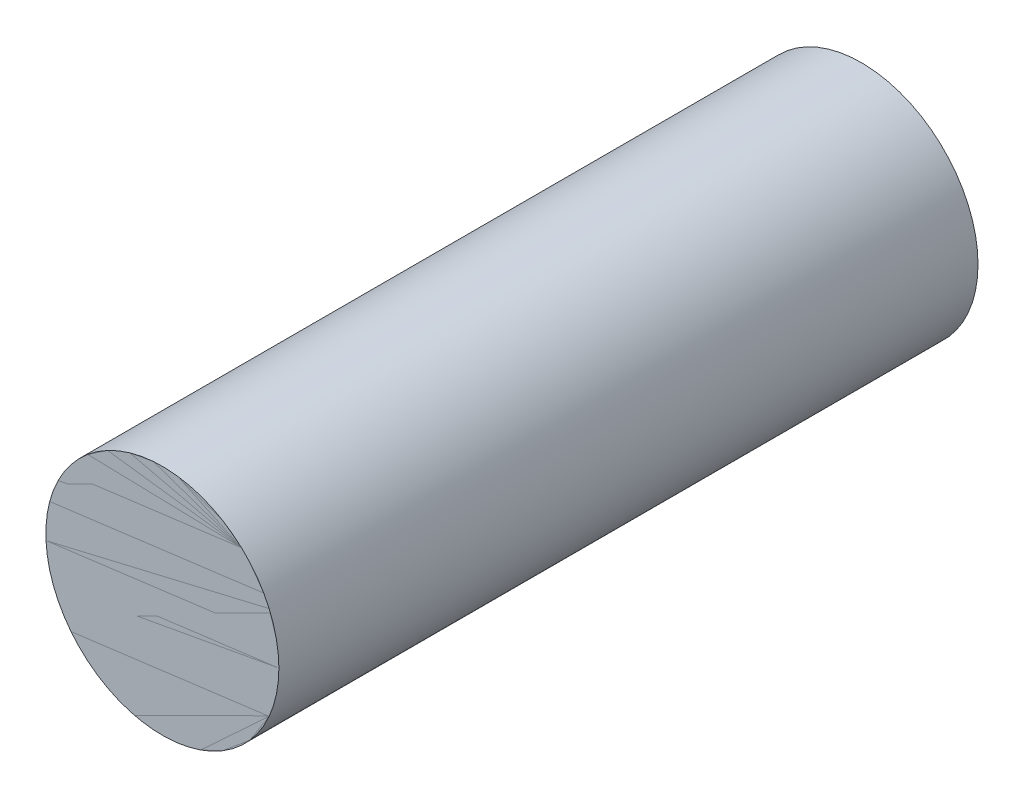
ISO-10303-21;
HEADER;
FILE_DESCRIPTION(('STEP AP214'),'2;1');
FILE_NAME('part.step','',(''),(''),'','','');
FILE_SCHEMA(('AUTOMOTIVE_DESIGN { 1 0 10303 214 1 1 1 1 }'));
ENDSEC;
DATA;
#1=APPLICATION_CONTEXT('core data for automotive mechanical design processes');
#2=APPLICATION_PROTOCOL_DEFINITION('international standard','automotive_design',2000,#1);
#3=PRODUCT_CONTEXT('',#1,'mechanical');
#4=PRODUCT('Part','Part','',(#3));
#5=PRODUCT_RELATED_PRODUCT_CATEGORY('part','',(#4));
#6=PRODUCT_DEFINITION_FORMATION('','',#4);
#7=PRODUCT_DEFINITION_CONTEXT('part definition',#1,'design');
#8=PRODUCT_DEFINITION('design','',#6,#7);
#9=PRODUCT_DEFINITION_SHAPE('','',#8);
#10=(LENGTH_UNIT() NAMED_UNIT(*) SI_UNIT(.MILLI.,.METRE.));
#11=(NAMED_UNIT(*) PLANE_ANGLE_UNIT() SI_UNIT($,.RADIAN.));
#12=(NAMED_UNIT(*) SI_UNIT($,.STERADIAN.) SOLID_ANGLE_UNIT());
#13=UNCERTAINTY_MEASURE_WITH_UNIT(LENGTH_MEASURE(1.E-05),#10,'distance_accuracy_value','');
#14=(GEOMETRIC_REPRESENTATION_CONTEXT(3) GLOBAL_UNCERTAINTY_ASSIGNED_CONTEXT((#13)) GLOBAL_UNIT_ASSIGNED_CONTEXT((#10,
#11,#12)) REPRESENTATION_CONTEXT('',''));
#15=CARTESIAN_POINT('',(0.,0.,0.));
#16=DIRECTION('',(0.,0.,1.));
#17=DIRECTION('',(1.,0.,0.));
#18=AXIS2_PLACEMENT_3D('',#15,#16,#17);
#19=CARTESIAN_POINT('',(-175.270710986926,-60.4180736437963,-9.79999999999999));
#20=DIRECTION('',(0.,0.,1.));
#21=DIRECTION('',(1.,0.,0.));
#22=AXIS2_PLACEMENT_3D('',#19,#20,#21);
#23=CYLINDRICAL_SURFACE('',#22,0.300000000000013);
#24=CARTESIAN_POINT('',(-175.270710986926,-60.4180736437963,-9.79999999999999));
#25=DIRECTION('',(0.,0.,1.));
#26=DIRECTION('',(1.,0.,0.));
#27=AXIS2_PLACEMENT_3D('',#24,#25,#26);
#28=CIRCLE('',#27,0.300000000000013);
#29=CARTESIAN_POINT('',(-174.970710986926,-60.4180736437963,-9.79999999999999));
#30=VERTEX_POINT('',#29);
#31=EDGE_CURVE('E11',#30,#30,#28,.T.);
#32=ORIENTED_EDGE('',*,*,#31,.T.);
#33=EDGE_LOOP('',(#32));
#34=FACE_BOUND('',#33,.T.);
#35=CARTESIAN_POINT('',(-175.270710986926,-60.4180736437963,-7.99999999999999));
#36=DIRECTION('',(0.,0.,1.));
#37=DIRECTION('',(1.,0.,0.));
#38=AXIS2_PLACEMENT_3D('',#35,#36,#37);
#39=CIRCLE('',#38,0.300000000000013);
#40=CARTESIAN_POINT('',(-174.970710986926,-60.4180736437963,-7.99999999999999));
#41=VERTEX_POINT('',#40);
#42=EDGE_CURVE('E46',#41,#41,#39,.T.);
#43=ORIENTED_EDGE('',*,*,#42,.F.);
#44=EDGE_LOOP('',(#43));
#45=FACE_BOUND('',#44,.T.);
#46=ADVANCED_FACE('F43',(#34,#45),#23,.T.);
#47=CARTESIAN_POINT('',(-175.270710986926,-60.4180736437963,-9.79999999999999));
#48=DIRECTION('',(0.,0.,1.));
#49=DIRECTION('',(1.,0.,0.));
#50=AXIS2_PLACEMENT_3D('',#47,#48,#49);
#51=PLANE('',#50);
#52=ORIENTED_EDGE('',*,*,#31,.F.);
#53=EDGE_LOOP('',(#52));
#54=FACE_BOUND('',#53,.T.);
#55=ADVANCED_FACE('F58',(#54),#51,.F.);
#56=CARTESIAN_POINT('',(-175.270710986926,-60.4180736437963,-7.99999999999999));
#57=DIRECTION('',(0.,0.,1.));
#58=DIRECTION('',(1.,0.,0.));
#59=AXIS2_PLACEMENT_3D('',#56,#57,#58);
#60=PLANE('',#59);
#61=ORIENTED_EDGE('',*,*,#42,.T.);
#62=EDGE_LOOP('',(#61));
#63=FACE_BOUND('',#62,.T.);
#64=ADVANCED_FACE('F55',(#63),#60,.T.);
#65=CLOSED_SHELL('',(#46,#55,#64));
#66=MANIFOLD_SOLID_BREP('B2',#65);
#67=CARTESIAN_POINT('',(-175.270710986926,-60.4180736437963,-7.99999999999999));
#68=DIRECTION('',(0.,0.,1.));
#69=DIRECTION('',(1.,0.,0.));
#70=AXIS2_PLACEMENT_3D('',#67,#68,#69);
#71=PLANE('',#70);
#72=CARTESIAN_POINT('',(-175.270710986926,-60.4180736437963,-7.99999999999999));
#73=DIRECTION('',(0.,0.,1.));
#74=DIRECTION('',(1.,0.,0.));
#75=AXIS2_PLACEMENT_3D('',#72,#73,#74);
#76=CIRCLE('',#75,0.300000000000022);
#77=CARTESIAN_POINT('',(-174.970710986926,-60.4180736437963,-7.99999999999999));
#78=VERTEX_POINT('',#77);
#79=EDGE_CURVE('E42',#78,#78,#76,.F.);
#80=ORIENTED_EDGE('',*,*,#79,.F.);
#81=EDGE_LOOP('',(#80));
#82=FACE_BOUND('',#81,.T.);
#83=ADVANCED_FACE('F83',(#82),#71,.T.);
#84=OPEN_SHELL('',(#83));
#85=SHELL_BASED_SURFACE_MODEL('B6',(#84));
#86=ADVANCED_BREP_SHAPE_REPRESENTATION('',(#18,#66),#14);
#87=MANIFOLD_SURFACE_SHAPE_REPRESENTATION('',(#18,#85),#14);
#88=SHAPE_REPRESENTATION('',(#18),#14);
#89=SHAPE_DEFINITION_REPRESENTATION(#9,#88);
#90=SHAPE_REPRESENTATION_RELATIONSHIP('','',#88,#86);
#91=SHAPE_REPRESENTATION_RELATIONSHIP('','',#88,#87);
ENDSEC;
END-ISO-10303-21;
